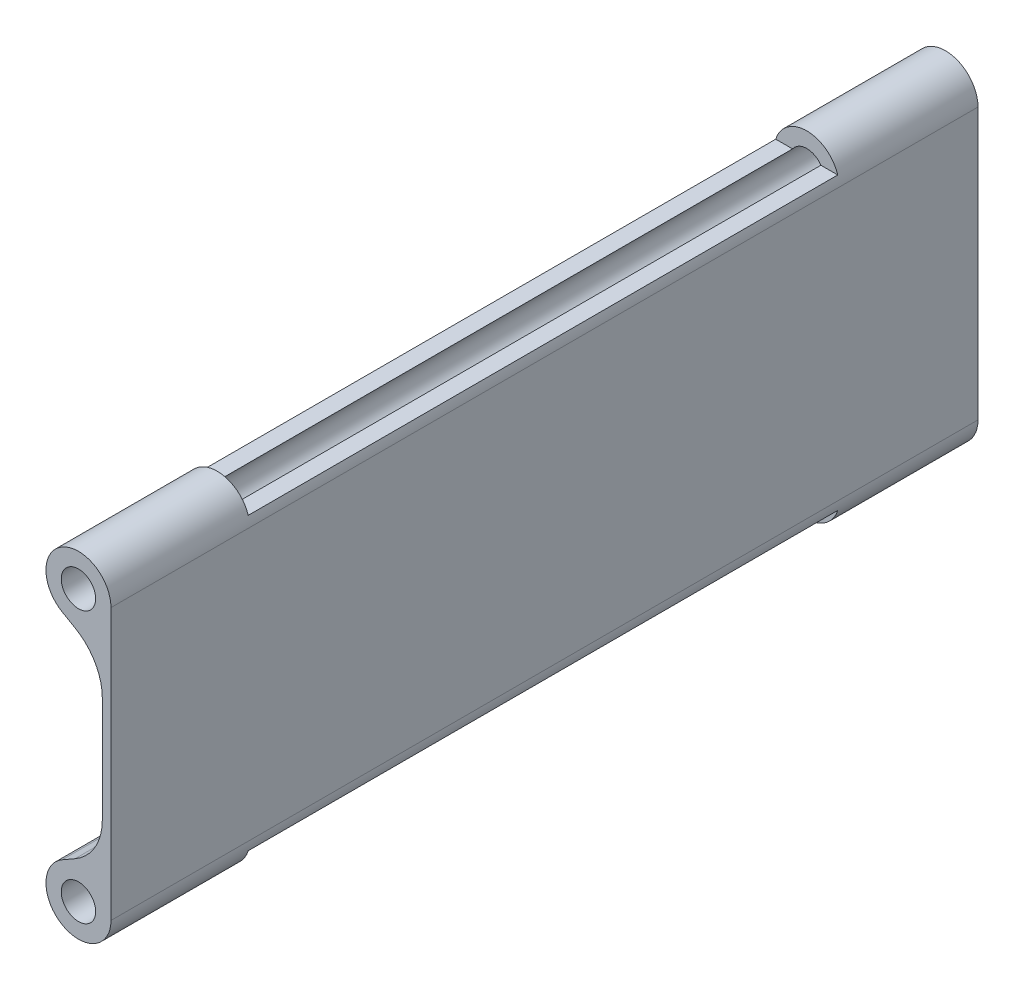
ISO-10303-21;
HEADER;
FILE_DESCRIPTION(('STEP AP214'),'2;1');
FILE_NAME('part.step','',(''),(''),'','','');
FILE_SCHEMA(('AUTOMOTIVE_DESIGN { 1 0 10303 214 1 1 1 1 }'));
ENDSEC;
DATA;
#1=APPLICATION_CONTEXT('core data for automotive mechanical design processes');
#2=APPLICATION_PROTOCOL_DEFINITION('international standard','automotive_design',2000,#1);
#3=PRODUCT_CONTEXT('',#1,'mechanical');
#4=PRODUCT('Part','Part','',(#3));
#5=PRODUCT_RELATED_PRODUCT_CATEGORY('part','',(#4));
#6=PRODUCT_DEFINITION_FORMATION('','',#4);
#7=PRODUCT_DEFINITION_CONTEXT('part definition',#1,'design');
#8=PRODUCT_DEFINITION('design','',#6,#7);
#9=PRODUCT_DEFINITION_SHAPE('','',#8);
#10=(LENGTH_UNIT() NAMED_UNIT(*) SI_UNIT(.MILLI.,.METRE.));
#11=(NAMED_UNIT(*) PLANE_ANGLE_UNIT() SI_UNIT($,.RADIAN.));
#12=(NAMED_UNIT(*) SI_UNIT($,.STERADIAN.) SOLID_ANGLE_UNIT());
#13=UNCERTAINTY_MEASURE_WITH_UNIT(LENGTH_MEASURE(1.E-05),#10,'distance_accuracy_value','');
#14=(GEOMETRIC_REPRESENTATION_CONTEXT(3) GLOBAL_UNCERTAINTY_ASSIGNED_CONTEXT((#13)) GLOBAL_UNIT_ASSIGNED_CONTEXT((#10,
#11,#12)) REPRESENTATION_CONTEXT('',''));
#15=CARTESIAN_POINT('',(0.,0.,0.));
#16=DIRECTION('',(0.,0.,1.));
#17=DIRECTION('',(1.,0.,0.));
#18=AXIS2_PLACEMENT_3D('',#15,#16,#17);
#19=CARTESIAN_POINT('',(-6.,25.,-160.));
#20=DIRECTION('',(0.,0.,1.));
#21=DIRECTION('',(1.,0.,0.));
#22=AXIS2_PLACEMENT_3D('',#19,#20,#21);
#23=CYLINDRICAL_SURFACE('',#22,6.);
#24=DIRECTION('',(0.,0.,1.));
#25=VECTOR('',#24,1.);
#26=CARTESIAN_POINT('',(-0.277123441186453,26.8024105782486,-160.));
#27=LINE('',#26,#25);
#28=CARTESIAN_POINT('',(-0.277123441186453,26.8024105782486,-25.604093846782));
#29=VERTEX_POINT('',#28);
#30=CARTESIAN_POINT('',(-0.277123441186453,26.8024105782486,-134.395906153218));
#31=VERTEX_POINT('',#30);
#32=EDGE_CURVE('E209',#29,#31,#27,.F.);
#33=ORIENTED_EDGE('',*,*,#32,.F.);
#34=CARTESIAN_POINT('',(-6.,25.,-25.604093846782));
#35=DIRECTION('',(0.,0.,1.));
#36=DIRECTION('',(0.,-1.,0.));
#37=AXIS2_PLACEMENT_3D('',#34,#35,#36);
#38=CIRCLE('',#37,6.);
#39=CARTESIAN_POINT('',(-11.7228765588135,26.8024105782486,-25.604093846782));
#40=VERTEX_POINT('',#39);
#41=EDGE_CURVE('E190',#40,#29,#38,.F.);
#42=ORIENTED_EDGE('',*,*,#41,.F.);
#43=DIRECTION('',(0.,0.,1.));
#44=VECTOR('',#43,1.);
#45=CARTESIAN_POINT('',(-11.7228765588135,26.8024105782486,-160.));
#46=LINE('',#45,#44);
#47=CARTESIAN_POINT('',(-11.7228765588135,26.8024105782486,-134.395906153218));
#48=VERTEX_POINT('',#47);
#49=EDGE_CURVE('E207',#48,#40,#46,.T.);
#50=ORIENTED_EDGE('',*,*,#49,.F.);
#51=CARTESIAN_POINT('',(-6.,25.,-134.395906153218));
#52=DIRECTION('',(0.,0.,-1.));
#53=DIRECTION('',(-1.,0.,0.));
#54=AXIS2_PLACEMENT_3D('',#51,#52,#53);
#55=CIRCLE('',#54,6.);
#56=EDGE_CURVE('E211',#31,#48,#55,.F.);
#57=ORIENTED_EDGE('',*,*,#56,.F.);
#58=EDGE_LOOP('',(#33,#42,#50,#57));
#59=FACE_BOUND('',#58,.T.);
#60=CARTESIAN_POINT('',(-6.,25.,0.));
#61=DIRECTION('',(0.,0.,1.));
#62=DIRECTION('',(1.,0.,0.));
#63=AXIS2_PLACEMENT_3D('',#60,#61,#62);
#64=CIRCLE('',#63,6.);
#65=CARTESIAN_POINT('',(0.,25.,0.));
#66=VERTEX_POINT('',#65);
#67=CARTESIAN_POINT('',(-8.98691390995378,19.7963142586697,0.));
#68=VERTEX_POINT('',#67);
#69=EDGE_CURVE('E224',#66,#68,#64,.T.);
#70=ORIENTED_EDGE('',*,*,#69,.F.);
#71=DIRECTION('',(0.,0.,1.));
#72=VECTOR('',#71,1.);
#73=CARTESIAN_POINT('',(0.,25.,-160.));
#74=LINE('',#73,#72);
#75=CARTESIAN_POINT('',(0.,25.,-160.));
#76=VERTEX_POINT('',#75);
#77=EDGE_CURVE('E261',#76,#66,#74,.T.);
#78=ORIENTED_EDGE('',*,*,#77,.F.);
#79=CARTESIAN_POINT('',(-6.,25.,-160.));
#80=DIRECTION('',(0.,0.,1.));
#81=DIRECTION('',(1.,0.,0.));
#82=AXIS2_PLACEMENT_3D('',#79,#80,#81);
#83=CIRCLE('',#82,6.);
#84=CARTESIAN_POINT('',(-8.98691390995378,19.7963142586697,-160.));
#85=VERTEX_POINT('',#84);
#86=EDGE_CURVE('E227',#76,#85,#83,.T.);
#87=ORIENTED_EDGE('',*,*,#86,.T.);
#88=DIRECTION('',(0.,0.,1.));
#89=VECTOR('',#88,1.);
#90=CARTESIAN_POINT('',(-8.98691390995378,19.7963142586697,-160.));
#91=LINE('',#90,#89);
#92=EDGE_CURVE('E245',#85,#68,#91,.T.);
#93=ORIENTED_EDGE('',*,*,#92,.T.);
#94=EDGE_LOOP('',(#70,#78,#87,#93));
#95=FACE_BOUND('',#94,.T.);
#96=ADVANCED_FACE('F32',(#59,#95),#23,.T.);
#97=CARTESIAN_POINT('',(0.,25.,-160.));
#98=DIRECTION('',(1.,0.,0.));
#99=DIRECTION('',(0.,0.,-1.));
#100=AXIS2_PLACEMENT_3D('',#97,#98,#99);
#101=PLANE('',#100);
#102=DIRECTION('',(0.,1.,0.));
#103=VECTOR('',#102,1.);
#104=CARTESIAN_POINT('',(0.,25.,0.));
#105=LINE('',#104,#103);
#106=CARTESIAN_POINT('',(0.,-25.,0.));
#107=VERTEX_POINT('',#106);
#108=EDGE_CURVE('E231',#107,#66,#105,.T.);
#109=ORIENTED_EDGE('',*,*,#108,.F.);
#110=DIRECTION('',(0.,0.,1.));
#111=VECTOR('',#110,1.);
#112=CARTESIAN_POINT('',(0.,-25.,-160.));
#113=LINE('',#112,#111);
#114=CARTESIAN_POINT('',(0.,-25.,-160.));
#115=VERTEX_POINT('',#114);
#116=EDGE_CURVE('E264',#115,#107,#113,.T.);
#117=ORIENTED_EDGE('',*,*,#116,.F.);
#118=DIRECTION('',(0.,1.,0.));
#119=VECTOR('',#118,1.);
#120=CARTESIAN_POINT('',(0.,25.,-160.));
#121=LINE('',#120,#119);
#122=EDGE_CURVE('E242',#115,#76,#121,.T.);
#123=ORIENTED_EDGE('',*,*,#122,.T.);
#124=ORIENTED_EDGE('',*,*,#77,.T.);
#125=EDGE_LOOP('',(#109,#117,#123,#124));
#126=FACE_BOUND('',#125,.T.);
#127=ADVANCED_FACE('F318',(#126),#101,.T.);
#128=CARTESIAN_POINT('',(-6.,-25.,-160.));
#129=DIRECTION('',(0.,0.,1.));
#130=DIRECTION('',(1.,0.,0.));
#131=AXIS2_PLACEMENT_3D('',#128,#129,#130);
#132=CYLINDRICAL_SURFACE('',#131,6.);
#133=CARTESIAN_POINT('',(-6.,-25.,-25.604093846782));
#134=DIRECTION('',(0.,0.,1.));
#135=DIRECTION('',(1.,0.,0.));
#136=AXIS2_PLACEMENT_3D('',#133,#134,#135);
#137=CIRCLE('',#136,6.);
#138=CARTESIAN_POINT('',(-0.277123441186453,-26.8024105782486,-25.604093846782));
#139=VERTEX_POINT('',#138);
#140=CARTESIAN_POINT('',(-11.7228765588135,-26.8024105782486,-25.604093846782));
#141=VERTEX_POINT('',#140);
#142=EDGE_CURVE('E205',#139,#141,#137,.F.);
#143=ORIENTED_EDGE('',*,*,#142,.F.);
#144=DIRECTION('',(0.,0.,1.));
#145=VECTOR('',#144,1.);
#146=CARTESIAN_POINT('',(-0.277123441186453,-26.8024105782486,-160.));
#147=LINE('',#146,#145);
#148=CARTESIAN_POINT('',(-0.277123441186453,-26.8024105782486,-134.395906153218));
#149=VERTEX_POINT('',#148);
#150=EDGE_CURVE('E202',#149,#139,#147,.T.);
#151=ORIENTED_EDGE('',*,*,#150,.F.);
#152=CARTESIAN_POINT('',(-6.,-25.,-134.395906153218));
#153=DIRECTION('',(0.,0.,-1.));
#154=DIRECTION('',(-1.,0.,0.));
#155=AXIS2_PLACEMENT_3D('',#152,#153,#154);
#156=CIRCLE('',#155,6.);
#157=CARTESIAN_POINT('',(-11.7228765588135,-26.8024105782486,-134.395906153218));
#158=VERTEX_POINT('',#157);
#159=EDGE_CURVE('E200',#158,#149,#156,.F.);
#160=ORIENTED_EDGE('',*,*,#159,.F.);
#161=DIRECTION('',(0.,0.,1.));
#162=VECTOR('',#161,1.);
#163=CARTESIAN_POINT('',(-11.7228765588135,-26.8024105782486,-160.));
#164=LINE('',#163,#162);
#165=EDGE_CURVE('E160',#141,#158,#164,.F.);
#166=ORIENTED_EDGE('',*,*,#165,.F.);
#167=EDGE_LOOP('',(#143,#151,#160,#166));
#168=FACE_BOUND('',#167,.T.);
#169=CARTESIAN_POINT('',(-6.,-25.,0.));
#170=DIRECTION('',(0.,0.,1.));
#171=DIRECTION('',(-1.,0.,0.));
#172=AXIS2_PLACEMENT_3D('',#169,#170,#171);
#173=CIRCLE('',#172,6.);
#174=CARTESIAN_POINT('',(-8.98691390995378,-19.7963142586697,0.));
#175=VERTEX_POINT('',#174);
#176=EDGE_CURVE('E256',#175,#107,#173,.T.);
#177=ORIENTED_EDGE('',*,*,#176,.F.);
#178=DIRECTION('',(0.,0.,1.));
#179=VECTOR('',#178,1.);
#180=CARTESIAN_POINT('',(-8.98691390995378,-19.7963142586697,-160.));
#181=LINE('',#180,#179);
#182=CARTESIAN_POINT('',(-8.98691390995378,-19.7963142586697,-160.));
#183=VERTEX_POINT('',#182);
#184=EDGE_CURVE('E266',#183,#175,#181,.T.);
#185=ORIENTED_EDGE('',*,*,#184,.F.);
#186=CARTESIAN_POINT('',(-6.,-25.,-160.));
#187=DIRECTION('',(0.,0.,1.));
#188=DIRECTION('',(-1.,0.,0.));
#189=AXIS2_PLACEMENT_3D('',#186,#187,#188);
#190=CIRCLE('',#189,6.);
#191=EDGE_CURVE('E239',#183,#115,#190,.T.);
#192=ORIENTED_EDGE('',*,*,#191,.T.);
#193=ORIENTED_EDGE('',*,*,#116,.T.);
#194=EDGE_LOOP('',(#177,#185,#192,#193));
#195=FACE_BOUND('',#194,.T.);
#196=ADVANCED_FACE('F315',(#168,#195),#132,.T.);
#197=CARTESIAN_POINT('',(-1.59999999999999,-15.556228095505,-160.));
#198=DIRECTION('',(-0.497818984992297,0.867280956888389,0.));
#199=DIRECTION('',(-0.867280956888389,-0.497818984992297,0.));
#200=AXIS2_PLACEMENT_3D('',#197,#198,#199);
#201=PLANE('',#200);
#202=DIRECTION('',(-0.867280956888389,-0.497818984992297,0.));
#203=VECTOR('',#202,1.);
#204=CARTESIAN_POINT('',(-1.59999999999999,-15.556228095505,0.));
#205=LINE('',#204,#203);
#206=CARTESIAN_POINT('',(-6.62181015007702,-18.4387454756913,0.));
#207=VERTEX_POINT('',#206);
#208=EDGE_CURVE('E254',#207,#175,#205,.T.);
#209=ORIENTED_EDGE('',*,*,#208,.F.);
#210=DIRECTION('',(0.,0.,1.));
#211=VECTOR('',#210,1.);
#212=CARTESIAN_POINT('',(-6.62181015007702,-18.4387454756913,-160.));
#213=LINE('',#212,#211);
#214=CARTESIAN_POINT('',(-6.62181015007702,-18.4387454756913,-160.));
#215=VERTEX_POINT('',#214);
#216=EDGE_CURVE('E274',#207,#215,#213,.F.);
#217=ORIENTED_EDGE('',*,*,#216,.T.);
#218=DIRECTION('',(-0.867280956888389,-0.497818984992297,0.));
#219=VECTOR('',#218,1.);
#220=CARTESIAN_POINT('',(-1.59999999999999,-15.556228095505,-160.));
#221=LINE('',#220,#219);
#222=EDGE_CURVE('E237',#215,#183,#221,.T.);
#223=ORIENTED_EDGE('',*,*,#222,.T.);
#224=ORIENTED_EDGE('',*,*,#184,.T.);
#225=EDGE_LOOP('',(#209,#217,#223,#224));
#226=FACE_BOUND('',#225,.T.);
#227=ADVANCED_FACE('F309',(#226),#201,.T.);
#228=CARTESIAN_POINT('',(-1.59999999999999,15.556228095505,-160.));
#229=DIRECTION('',(-1.,0.,0.));
#230=DIRECTION('',(0.,0.,1.));
#231=AXIS2_PLACEMENT_3D('',#228,#229,#230);
#232=PLANE('',#231);
#233=DIRECTION('',(0.,-1.,0.));
#234=VECTOR('',#233,1.);
#235=CARTESIAN_POINT('',(-1.59999999999999,15.556228095505,-160.));
#236=LINE('',#235,#234);
#237=CARTESIAN_POINT('',(-1.59999999999999,9.76593590680739,-160.));
#238=VERTEX_POINT('',#237);
#239=CARTESIAN_POINT('',(-1.59999999999999,-9.76593590680739,-160.));
#240=VERTEX_POINT('',#239);
#241=EDGE_CURVE('E234',#238,#240,#236,.T.);
#242=ORIENTED_EDGE('',*,*,#241,.T.);
#243=DIRECTION('',(0.,0.,1.));
#244=VECTOR('',#243,1.);
#245=CARTESIAN_POINT('',(-1.6,-9.76593590680739,0.));
#246=LINE('',#245,#244);
#247=CARTESIAN_POINT('',(-1.59999999999999,-9.76593590680739,0.));
#248=VERTEX_POINT('',#247);
#249=EDGE_CURVE('E271',#240,#248,#246,.T.);
#250=ORIENTED_EDGE('',*,*,#249,.T.);
#251=DIRECTION('',(0.,-1.,0.));
#252=VECTOR('',#251,1.);
#253=CARTESIAN_POINT('',(-1.59999999999999,15.556228095505,0.));
#254=LINE('',#253,#252);
#255=CARTESIAN_POINT('',(-1.59999999999999,9.76593590680739,0.));
#256=VERTEX_POINT('',#255);
#257=EDGE_CURVE('E251',#256,#248,#254,.T.);
#258=ORIENTED_EDGE('',*,*,#257,.F.);
#259=DIRECTION('',(0.,0.,1.));
#260=VECTOR('',#259,1.);
#261=CARTESIAN_POINT('',(-1.6,9.76593590680739,-160.));
#262=LINE('',#261,#260);
#263=EDGE_CURVE('E263',#256,#238,#262,.F.);
#264=ORIENTED_EDGE('',*,*,#263,.T.);
#265=EDGE_LOOP('',(#242,#250,#258,#264));
#266=FACE_BOUND('',#265,.T.);
#267=ADVANCED_FACE('F301',(#266),#232,.T.);
#268=CARTESIAN_POINT('',(-1.59999999999999,15.556228095505,-160.));
#269=DIRECTION('',(-0.497818984992297,-0.867280956888389,0.));
#270=DIRECTION('',(0.867280956888389,-0.497818984992297,0.));
#271=AXIS2_PLACEMENT_3D('',#268,#269,#270);
#272=PLANE('',#271);
#273=DIRECTION('',(0.867280956888389,-0.497818984992297,0.));
#274=VECTOR('',#273,1.);
#275=CARTESIAN_POINT('',(-1.59999999999999,15.556228095505,-160.));
#276=LINE('',#275,#274);
#277=CARTESIAN_POINT('',(-6.62181015007702,18.4387454756913,-160.));
#278=VERTEX_POINT('',#277);
#279=EDGE_CURVE('E230',#85,#278,#276,.T.);
#280=ORIENTED_EDGE('',*,*,#279,.T.);
#281=DIRECTION('',(0.,0.,1.));
#282=VECTOR('',#281,1.);
#283=CARTESIAN_POINT('',(-6.62181015007702,18.4387454756913,0.));
#284=LINE('',#283,#282);
#285=CARTESIAN_POINT('',(-6.62181015007702,18.4387454756913,0.));
#286=VERTEX_POINT('',#285);
#287=EDGE_CURVE('E276',#278,#286,#284,.T.);
#288=ORIENTED_EDGE('',*,*,#287,.T.);
#289=DIRECTION('',(0.867280956888389,-0.497818984992297,0.));
#290=VECTOR('',#289,1.);
#291=CARTESIAN_POINT('',(-1.59999999999999,15.556228095505,0.));
#292=LINE('',#291,#290);
#293=EDGE_CURVE('E248',#68,#286,#292,.T.);
#294=ORIENTED_EDGE('',*,*,#293,.F.);
#295=ORIENTED_EDGE('',*,*,#92,.F.);
#296=EDGE_LOOP('',(#280,#288,#294,#295));
#297=FACE_BOUND('',#296,.T.);
#298=ADVANCED_FACE('F295',(#297),#272,.T.);
#299=CARTESIAN_POINT('',(-6.,25.,-160.));
#300=DIRECTION('',(0.,0.,1.));
#301=DIRECTION('',(1.,0.,0.));
#302=AXIS2_PLACEMENT_3D('',#299,#300,#301);
#303=PLANE('',#302);
#304=CARTESIAN_POINT('',(-6.,-25.,-160.));
#305=DIRECTION('',(0.,0.,1.));
#306=DIRECTION('',(-1.,0.,0.));
#307=AXIS2_PLACEMENT_3D('',#304,#305,#306);
#308=CIRCLE('',#307,3.175);
#309=CARTESIAN_POINT('',(-9.175,-25.,-160.));
#310=VERTEX_POINT('',#309);
#311=EDGE_CURVE('E215',#310,#310,#308,.T.);
#312=ORIENTED_EDGE('',*,*,#311,.T.);
#313=EDGE_LOOP('',(#312));
#314=FACE_BOUND('',#313,.T.);
#315=CARTESIAN_POINT('',(-6.,25.,-160.));
#316=DIRECTION('',(0.,0.,1.));
#317=DIRECTION('',(1.,0.,0.));
#318=AXIS2_PLACEMENT_3D('',#315,#316,#317);
#319=CIRCLE('',#318,3.175);
#320=CARTESIAN_POINT('',(-2.825,25.,-160.));
#321=VERTEX_POINT('',#320);
#322=EDGE_CURVE('E221',#321,#321,#319,.T.);
#323=ORIENTED_EDGE('',*,*,#322,.T.);
#324=EDGE_LOOP('',(#323));
#325=FACE_BOUND('',#324,.T.);
#326=ORIENTED_EDGE('',*,*,#86,.F.);
#327=ORIENTED_EDGE('',*,*,#122,.F.);
#328=ORIENTED_EDGE('',*,*,#191,.F.);
#329=ORIENTED_EDGE('',*,*,#222,.F.);
#330=CARTESIAN_POINT('',(-11.6,-9.76593590680739,-160.));
#331=DIRECTION('',(0.,0.,1.));
#332=DIRECTION('',(1.,0.,0.));
#333=AXIS2_PLACEMENT_3D('',#330,#331,#332);
#334=CIRCLE('',#333,10.);
#335=EDGE_CURVE('E281',#215,#240,#334,.T.);
#336=ORIENTED_EDGE('',*,*,#335,.T.);
#337=ORIENTED_EDGE('',*,*,#241,.F.);
#338=CARTESIAN_POINT('',(-11.6,9.76593590680739,-160.));
#339=DIRECTION('',(0.,0.,1.));
#340=DIRECTION('',(1.,0.,0.));
#341=AXIS2_PLACEMENT_3D('',#338,#339,#340);
#342=CIRCLE('',#341,10.);
#343=EDGE_CURVE('E152',#238,#278,#342,.T.);
#344=ORIENTED_EDGE('',*,*,#343,.T.);
#345=ORIENTED_EDGE('',*,*,#279,.F.);
#346=EDGE_LOOP('',(#326,#327,#328,#329,#336,#337,#344,#345));
#347=FACE_BOUND('',#346,.T.);
#348=ADVANCED_FACE('F290',(#314,#325,#347),#303,.F.);
#349=CARTESIAN_POINT('',(-6.,25.,0.));
#350=DIRECTION('',(0.,0.,1.));
#351=DIRECTION('',(1.,0.,0.));
#352=AXIS2_PLACEMENT_3D('',#349,#350,#351);
#353=PLANE('',#352);
#354=CARTESIAN_POINT('',(-6.,-25.,0.));
#355=DIRECTION('',(0.,0.,1.));
#356=DIRECTION('',(-1.,0.,0.));
#357=AXIS2_PLACEMENT_3D('',#354,#355,#356);
#358=CIRCLE('',#357,3.175);
#359=CARTESIAN_POINT('',(-9.175,-25.,0.));
#360=VERTEX_POINT('',#359);
#361=EDGE_CURVE('E214',#360,#360,#358,.T.);
#362=ORIENTED_EDGE('',*,*,#361,.F.);
#363=EDGE_LOOP('',(#362));
#364=FACE_BOUND('',#363,.T.);
#365=CARTESIAN_POINT('',(-6.,25.,0.));
#366=DIRECTION('',(0.,0.,1.));
#367=DIRECTION('',(1.,0.,0.));
#368=AXIS2_PLACEMENT_3D('',#365,#366,#367);
#369=CIRCLE('',#368,3.175);
#370=CARTESIAN_POINT('',(-2.825,25.,0.));
#371=VERTEX_POINT('',#370);
#372=EDGE_CURVE('E218',#371,#371,#369,.T.);
#373=ORIENTED_EDGE('',*,*,#372,.F.);
#374=EDGE_LOOP('',(#373));
#375=FACE_BOUND('',#374,.T.);
#376=ORIENTED_EDGE('',*,*,#69,.T.);
#377=ORIENTED_EDGE('',*,*,#293,.T.);
#378=CARTESIAN_POINT('',(-11.6,9.76593590680739,0.));
#379=DIRECTION('',(0.,0.,1.));
#380=DIRECTION('',(1.,0.,0.));
#381=AXIS2_PLACEMENT_3D('',#378,#379,#380);
#382=CIRCLE('',#381,10.);
#383=EDGE_CURVE('E283',#286,#256,#382,.F.);
#384=ORIENTED_EDGE('',*,*,#383,.T.);
#385=ORIENTED_EDGE('',*,*,#257,.T.);
#386=CARTESIAN_POINT('',(-11.6,-9.76593590680739,0.));
#387=DIRECTION('',(0.,0.,1.));
#388=DIRECTION('',(1.,0.,0.));
#389=AXIS2_PLACEMENT_3D('',#386,#387,#388);
#390=CIRCLE('',#389,10.);
#391=EDGE_CURVE('E279',#248,#207,#390,.F.);
#392=ORIENTED_EDGE('',*,*,#391,.T.);
#393=ORIENTED_EDGE('',*,*,#208,.T.);
#394=ORIENTED_EDGE('',*,*,#176,.T.);
#395=ORIENTED_EDGE('',*,*,#108,.T.);
#396=EDGE_LOOP('',(#376,#377,#384,#385,#392,#393,#394,#395));
#397=FACE_BOUND('',#396,.T.);
#398=ADVANCED_FACE('F299',(#364,#375,#397),#353,.T.);
#399=CARTESIAN_POINT('',(-6.,25.,-160.));
#400=DIRECTION('',(0.,0.,1.));
#401=DIRECTION('',(1.,0.,0.));
#402=AXIS2_PLACEMENT_3D('',#399,#400,#401);
#403=CYLINDRICAL_SURFACE('',#402,3.175);
#404=CARTESIAN_POINT('',(-6.,25.,-25.604093846782));
#405=DIRECTION('',(0.,0.,1.));
#406=DIRECTION('',(0.,-1.,0.));
#407=AXIS2_PLACEMENT_3D('',#404,#405,#406);
#408=CIRCLE('',#407,3.175);
#409=CARTESIAN_POINT('',(-8.61379821474756,26.8024105782486,-25.604093846782));
#410=VERTEX_POINT('',#409);
#411=CARTESIAN_POINT('',(-3.38620178525243,26.8024105782486,-25.604093846782));
#412=VERTEX_POINT('',#411);
#413=EDGE_CURVE('E40',#410,#412,#408,.F.);
#414=ORIENTED_EDGE('',*,*,#413,.T.);
#415=DIRECTION('',(0.,0.,1.));
#416=VECTOR('',#415,1.);
#417=CARTESIAN_POINT('',(-3.38620178525243,26.8024105782486,-160.));
#418=LINE('',#417,#416);
#419=CARTESIAN_POINT('',(-3.38620178525243,26.8024105782486,-134.395906153218));
#420=VERTEX_POINT('',#419);
#421=EDGE_CURVE('E11',#412,#420,#418,.F.);
#422=ORIENTED_EDGE('',*,*,#421,.T.);
#423=CARTESIAN_POINT('',(-6.,25.,-134.395906153218));
#424=DIRECTION('',(0.,0.,-1.));
#425=DIRECTION('',(-1.,0.,0.));
#426=AXIS2_PLACEMENT_3D('',#423,#424,#425);
#427=CIRCLE('',#426,3.175);
#428=CARTESIAN_POINT('',(-8.61379821474756,26.8024105782486,-134.395906153218));
#429=VERTEX_POINT('',#428);
#430=EDGE_CURVE('E175',#420,#429,#427,.F.);
#431=ORIENTED_EDGE('',*,*,#430,.T.);
#432=DIRECTION('',(0.,0.,1.));
#433=VECTOR('',#432,1.);
#434=CARTESIAN_POINT('',(-8.61379821474756,26.8024105782486,-160.));
#435=LINE('',#434,#433);
#436=EDGE_CURVE('E169',#429,#410,#435,.T.);
#437=ORIENTED_EDGE('',*,*,#436,.T.);
#438=EDGE_LOOP('',(#414,#422,#431,#437));
#439=FACE_BOUND('',#438,.T.);
#440=ORIENTED_EDGE('',*,*,#322,.F.);
#441=EDGE_LOOP('',(#440));
#442=FACE_BOUND('',#441,.T.);
#443=ORIENTED_EDGE('',*,*,#372,.T.);
#444=EDGE_LOOP('',(#443));
#445=FACE_BOUND('',#444,.T.);
#446=ADVANCED_FACE('F180',(#439,#442,#445),#403,.F.);
#447=CARTESIAN_POINT('',(-6.,-25.,-160.));
#448=DIRECTION('',(0.,0.,1.));
#449=DIRECTION('',(1.,0.,0.));
#450=AXIS2_PLACEMENT_3D('',#447,#448,#449);
#451=CYLINDRICAL_SURFACE('',#450,3.175);
#452=DIRECTION('',(0.,0.,1.));
#453=VECTOR('',#452,1.);
#454=CARTESIAN_POINT('',(-3.38620178525243,-26.8024105782486,-160.));
#455=LINE('',#454,#453);
#456=CARTESIAN_POINT('',(-3.38620178525243,-26.8024105782486,-134.395906153218));
#457=VERTEX_POINT('',#456);
#458=CARTESIAN_POINT('',(-3.38620178525243,-26.8024105782486,-25.604093846782));
#459=VERTEX_POINT('',#458);
#460=EDGE_CURVE('E151',#457,#459,#455,.T.);
#461=ORIENTED_EDGE('',*,*,#460,.T.);
#462=CARTESIAN_POINT('',(-6.,-25.,-25.604093846782));
#463=DIRECTION('',(0.,0.,1.));
#464=DIRECTION('',(1.,0.,0.));
#465=AXIS2_PLACEMENT_3D('',#462,#463,#464);
#466=CIRCLE('',#465,3.175);
#467=CARTESIAN_POINT('',(-8.61379821474756,-26.8024105782486,-25.604093846782));
#468=VERTEX_POINT('',#467);
#469=EDGE_CURVE('E167',#459,#468,#466,.F.);
#470=ORIENTED_EDGE('',*,*,#469,.T.);
#471=DIRECTION('',(0.,0.,1.));
#472=VECTOR('',#471,1.);
#473=CARTESIAN_POINT('',(-8.61379821474756,-26.8024105782486,-160.));
#474=LINE('',#473,#472);
#475=CARTESIAN_POINT('',(-8.61379821474756,-26.8024105782486,-134.395906153218));
#476=VERTEX_POINT('',#475);
#477=EDGE_CURVE('E157',#468,#476,#474,.F.);
#478=ORIENTED_EDGE('',*,*,#477,.T.);
#479=CARTESIAN_POINT('',(-6.,-25.,-134.395906153218));
#480=DIRECTION('',(0.,0.,-1.));
#481=DIRECTION('',(-1.,0.,0.));
#482=AXIS2_PLACEMENT_3D('',#479,#480,#481);
#483=CIRCLE('',#482,3.175);
#484=EDGE_CURVE('E143',#476,#457,#483,.F.);
#485=ORIENTED_EDGE('',*,*,#484,.T.);
#486=EDGE_LOOP('',(#461,#470,#478,#485));
#487=FACE_BOUND('',#486,.T.);
#488=ORIENTED_EDGE('',*,*,#311,.F.);
#489=EDGE_LOOP('',(#488));
#490=FACE_BOUND('',#489,.T.);
#491=ORIENTED_EDGE('',*,*,#361,.T.);
#492=EDGE_LOOP('',(#491));
#493=FACE_BOUND('',#492,.T.);
#494=ADVANCED_FACE('F165',(#487,#490,#493),#451,.F.);
#495=CARTESIAN_POINT('',(-11.6,-9.76593590680739,-160.));
#496=DIRECTION('',(0.,0.,-1.));
#497=DIRECTION('',(-1.,0.,0.));
#498=AXIS2_PLACEMENT_3D('',#495,#496,#497);
#499=CYLINDRICAL_SURFACE('',#498,10.);
#500=ORIENTED_EDGE('',*,*,#335,.F.);
#501=ORIENTED_EDGE('',*,*,#216,.F.);
#502=ORIENTED_EDGE('',*,*,#391,.F.);
#503=ORIENTED_EDGE('',*,*,#249,.F.);
#504=EDGE_LOOP('',(#500,#501,#502,#503));
#505=FACE_BOUND('',#504,.T.);
#506=ADVANCED_FACE('F305',(#505),#499,.F.);
#507=CARTESIAN_POINT('',(-11.6,9.76593590680739,-160.));
#508=DIRECTION('',(0.,0.,-1.));
#509=DIRECTION('',(-1.,0.,0.));
#510=AXIS2_PLACEMENT_3D('',#507,#508,#509);
#511=CYLINDRICAL_SURFACE('',#510,10.);
#512=ORIENTED_EDGE('',*,*,#343,.F.);
#513=ORIENTED_EDGE('',*,*,#263,.F.);
#514=ORIENTED_EDGE('',*,*,#383,.F.);
#515=ORIENTED_EDGE('',*,*,#287,.F.);
#516=EDGE_LOOP('',(#512,#513,#514,#515));
#517=FACE_BOUND('',#516,.T.);
#518=ADVANCED_FACE('F34',(#517),#511,.F.);
#519=CARTESIAN_POINT('',(-12.,-44.9478454916756,-25.604093846782));
#520=DIRECTION('',(0.,0.,1.));
#521=DIRECTION('',(1.,0.,0.));
#522=AXIS2_PLACEMENT_3D('',#519,#520,#521);
#523=PLANE('',#522);
#524=ORIENTED_EDGE('',*,*,#142,.T.);
#525=DIRECTION('',(1.,0.,0.));
#526=VECTOR('',#525,1.);
#527=CARTESIAN_POINT('',(-12.,-26.8024105782486,-25.604093846782));
#528=LINE('',#527,#526);
#529=EDGE_CURVE('E193',#141,#468,#528,.T.);
#530=ORIENTED_EDGE('',*,*,#529,.T.);
#531=ORIENTED_EDGE('',*,*,#469,.F.);
#532=EDGE_CURVE('E162',#459,#139,#528,.T.);
#533=ORIENTED_EDGE('',*,*,#532,.T.);
#534=EDGE_LOOP('',(#524,#530,#531,#533));
#535=FACE_BOUND('',#534,.T.);
#536=ADVANCED_FACE('F336',(#535),#523,.F.);
#537=CARTESIAN_POINT('',(-12.,-26.8024105782486,-25.604093846782));
#538=DIRECTION('',(0.,1.,0.));
#539=DIRECTION('',(0.,0.,1.));
#540=AXIS2_PLACEMENT_3D('',#537,#538,#539);
#541=PLANE('',#540);
#542=ORIENTED_EDGE('',*,*,#165,.T.);
#543=DIRECTION('',(1.,0.,0.));
#544=VECTOR('',#543,1.);
#545=CARTESIAN_POINT('',(-12.,-26.8024105782486,-134.395906153218));
#546=LINE('',#545,#544);
#547=EDGE_CURVE('E55',#158,#476,#546,.T.);
#548=ORIENTED_EDGE('',*,*,#547,.T.);
#549=ORIENTED_EDGE('',*,*,#477,.F.);
#550=ORIENTED_EDGE('',*,*,#529,.F.);
#551=EDGE_LOOP('',(#542,#548,#549,#550));
#552=FACE_BOUND('',#551,.T.);
#553=ADVANCED_FACE('F155',(#552),#541,.F.);
#554=ORIENTED_EDGE('',*,*,#150,.T.);
#555=ORIENTED_EDGE('',*,*,#532,.F.);
#556=ORIENTED_EDGE('',*,*,#460,.F.);
#557=EDGE_CURVE('E146',#457,#149,#546,.T.);
#558=ORIENTED_EDGE('',*,*,#557,.T.);
#559=EDGE_LOOP('',(#554,#555,#556,#558));
#560=FACE_BOUND('',#559,.T.);
#561=ADVANCED_FACE('F400',(#560),#541,.F.);
#562=CARTESIAN_POINT('',(-12.,-44.9478454916756,-134.395906153218));
#563=DIRECTION('',(0.,0.,-1.));
#564=DIRECTION('',(-1.,0.,0.));
#565=AXIS2_PLACEMENT_3D('',#562,#563,#564);
#566=PLANE('',#565);
#567=ORIENTED_EDGE('',*,*,#159,.T.);
#568=ORIENTED_EDGE('',*,*,#557,.F.);
#569=ORIENTED_EDGE('',*,*,#484,.F.);
#570=ORIENTED_EDGE('',*,*,#547,.F.);
#571=EDGE_LOOP('',(#567,#568,#569,#570));
#572=FACE_BOUND('',#571,.T.);
#573=ADVANCED_FACE('F144',(#572),#566,.F.);
#574=CARTESIAN_POINT('',(-12.,44.9478454916756,-25.604093846782));
#575=DIRECTION('',(0.,0.,1.));
#576=DIRECTION('',(0.,-1.,0.));
#577=AXIS2_PLACEMENT_3D('',#574,#575,#576);
#578=PLANE('',#577);
#579=ORIENTED_EDGE('',*,*,#41,.T.);
#580=DIRECTION('',(1.,0.,0.));
#581=VECTOR('',#580,1.);
#582=CARTESIAN_POINT('',(-12.,26.8024105782486,-25.604093846782));
#583=LINE('',#582,#581);
#584=EDGE_CURVE('E189',#412,#29,#583,.T.);
#585=ORIENTED_EDGE('',*,*,#584,.F.);
#586=ORIENTED_EDGE('',*,*,#413,.F.);
#587=EDGE_CURVE('E186',#40,#410,#583,.T.);
#588=ORIENTED_EDGE('',*,*,#587,.F.);
#589=EDGE_LOOP('',(#579,#585,#586,#588));
#590=FACE_BOUND('',#589,.T.);
#591=ADVANCED_FACE('F185',(#590),#578,.F.);
#592=CARTESIAN_POINT('',(-12.,44.9478454916756,-134.395906153218));
#593=DIRECTION('',(0.,0.,-1.));
#594=DIRECTION('',(-1.,0.,0.));
#595=AXIS2_PLACEMENT_3D('',#592,#593,#594);
#596=PLANE('',#595);
#597=ORIENTED_EDGE('',*,*,#56,.T.);
#598=DIRECTION('',(1.,0.,0.));
#599=VECTOR('',#598,1.);
#600=CARTESIAN_POINT('',(-12.,26.8024105782486,-134.395906153218));
#601=LINE('',#600,#599);
#602=EDGE_CURVE('E47',#48,#429,#601,.T.);
#603=ORIENTED_EDGE('',*,*,#602,.T.);
#604=ORIENTED_EDGE('',*,*,#430,.F.);
#605=EDGE_CURVE('E195',#420,#31,#601,.T.);
#606=ORIENTED_EDGE('',*,*,#605,.T.);
#607=EDGE_LOOP('',(#597,#603,#604,#606));
#608=FACE_BOUND('',#607,.T.);
#609=ADVANCED_FACE('F423',(#608),#596,.F.);
#610=CARTESIAN_POINT('',(-12.,26.8024105782486,-25.604093846782));
#611=DIRECTION('',(0.,-1.,0.));
#612=DIRECTION('',(0.,0.,-1.));
#613=AXIS2_PLACEMENT_3D('',#610,#611,#612);
#614=PLANE('',#613);
#615=ORIENTED_EDGE('',*,*,#32,.T.);
#616=ORIENTED_EDGE('',*,*,#605,.F.);
#617=ORIENTED_EDGE('',*,*,#421,.F.);
#618=ORIENTED_EDGE('',*,*,#584,.T.);
#619=EDGE_LOOP('',(#615,#616,#617,#618));
#620=FACE_BOUND('',#619,.T.);
#621=ADVANCED_FACE('F432',(#620),#614,.F.);
#622=ORIENTED_EDGE('',*,*,#49,.T.);
#623=ORIENTED_EDGE('',*,*,#587,.T.);
#624=ORIENTED_EDGE('',*,*,#436,.F.);
#625=ORIENTED_EDGE('',*,*,#602,.F.);
#626=EDGE_LOOP('',(#622,#623,#624,#625));
#627=FACE_BOUND('',#626,.T.);
#628=ADVANCED_FACE('F442',(#627),#614,.F.);
#629=CLOSED_SHELL('',(#96,#127,#196,#227,#267,#298,#348,#398,#446,#494,#506,#518,#536,#553,#561,
#573,#591,#609,#621,#628));
#630=MANIFOLD_SOLID_BREP('B2',#629);
#631=ADVANCED_BREP_SHAPE_REPRESENTATION('',(#18,#630),#14);
#632=SHAPE_DEFINITION_REPRESENTATION(#9,#631);
ENDSEC;
END-ISO-10303-21;
